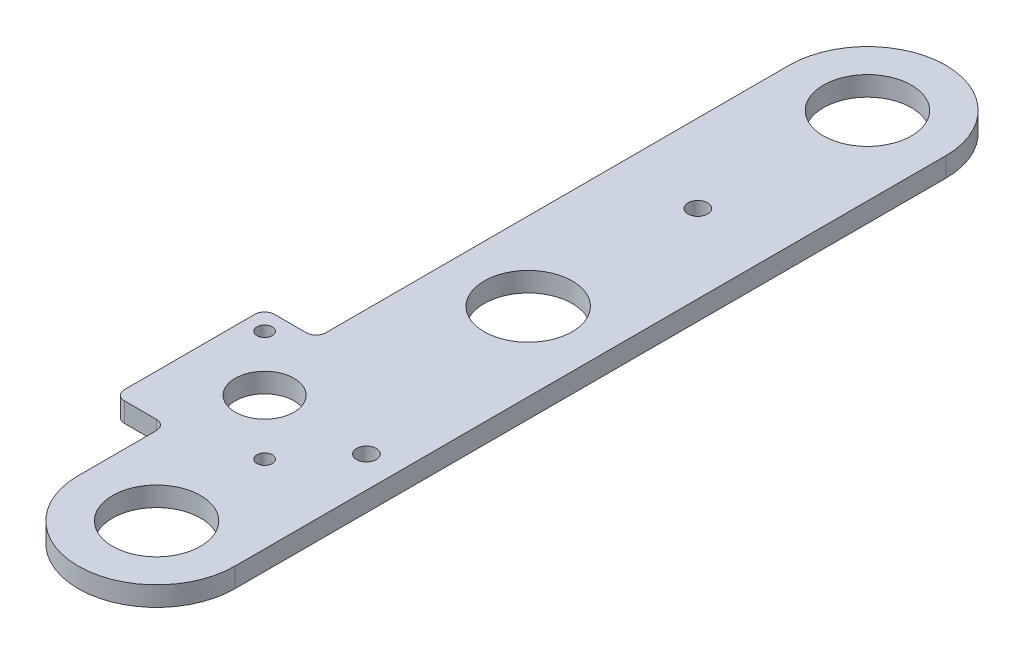
ISO-10303-21;
HEADER;
FILE_DESCRIPTION(('STEP AP214'),'2;1');
FILE_NAME('part.step','',(''),(''),'','','');
FILE_SCHEMA(('AUTOMOTIVE_DESIGN { 1 0 10303 214 1 1 1 1 }'));
ENDSEC;
DATA;
#1=APPLICATION_CONTEXT('core data for automotive mechanical design processes');
#2=APPLICATION_PROTOCOL_DEFINITION('international standard','automotive_design',2000,#1);
#3=PRODUCT_CONTEXT('',#1,'mechanical');
#4=PRODUCT('Part','Part','',(#3));
#5=PRODUCT_RELATED_PRODUCT_CATEGORY('part','',(#4));
#6=PRODUCT_DEFINITION_FORMATION('','',#4);
#7=PRODUCT_DEFINITION_CONTEXT('part definition',#1,'design');
#8=PRODUCT_DEFINITION('design','',#6,#7);
#9=PRODUCT_DEFINITION_SHAPE('','',#8);
#10=(LENGTH_UNIT() NAMED_UNIT(*) SI_UNIT(.MILLI.,.METRE.));
#11=(NAMED_UNIT(*) PLANE_ANGLE_UNIT() SI_UNIT($,.RADIAN.));
#12=(NAMED_UNIT(*) SI_UNIT($,.STERADIAN.) SOLID_ANGLE_UNIT());
#13=UNCERTAINTY_MEASURE_WITH_UNIT(LENGTH_MEASURE(1.E-05),#10,'distance_accuracy_value','');
#14=(GEOMETRIC_REPRESENTATION_CONTEXT(3) GLOBAL_UNCERTAINTY_ASSIGNED_CONTEXT((#13)) GLOBAL_UNIT_ASSIGNED_CONTEXT((#10,
#11,#12)) REPRESENTATION_CONTEXT('',''));
#15=CARTESIAN_POINT('',(0.,0.,0.));
#16=DIRECTION('',(0.,0.,1.));
#17=DIRECTION('',(1.,0.,0.));
#18=AXIS2_PLACEMENT_3D('',#15,#16,#17);
#19=CARTESIAN_POINT('',(-239.395,6.35,-397.808393353847));
#20=DIRECTION('',(0.,-1.,0.));
#21=DIRECTION('',(0.,0.,-1.));
#22=AXIS2_PLACEMENT_3D('',#19,#20,#21);
#23=CYLINDRICAL_SURFACE('',#22,3.17500000000003);
#24=CARTESIAN_POINT('',(-239.395,0.,-397.808393353847));
#25=DIRECTION('',(0.,1.,0.));
#26=DIRECTION('',(0.,0.,1.));
#27=AXIS2_PLACEMENT_3D('',#24,#25,#26);
#28=CIRCLE('',#27,3.17500000000003);
#29=CARTESIAN_POINT('',(-239.395,0.,-394.633393353847));
#30=VERTEX_POINT('',#29);
#31=CARTESIAN_POINT('',(-236.22,0.,-397.808393353847));
#32=VERTEX_POINT('',#31);
#33=EDGE_CURVE('E178',#30,#32,#28,.T.);
#34=ORIENTED_EDGE('',*,*,#33,.F.);
#35=DIRECTION('',(0.,-1.,0.));
#36=VECTOR('',#35,1.);
#37=CARTESIAN_POINT('',(-239.395,6.35,-394.633393353847));
#38=LINE('',#37,#36);
#39=CARTESIAN_POINT('',(-239.395,6.35,-394.633393353847));
#40=VERTEX_POINT('',#39);
#41=EDGE_CURVE('E11',#40,#30,#38,.T.);
#42=ORIENTED_EDGE('',*,*,#41,.F.);
#43=CARTESIAN_POINT('',(-239.395,6.35,-397.808393353847));
#44=DIRECTION('',(0.,1.,0.));
#45=DIRECTION('',(0.,0.,1.));
#46=AXIS2_PLACEMENT_3D('',#43,#44,#45);
#47=CIRCLE('',#46,3.17500000000003);
#48=CARTESIAN_POINT('',(-236.22,6.35,-397.808393353847));
#49=VERTEX_POINT('',#48);
#50=EDGE_CURVE('E259',#40,#49,#47,.T.);
#51=ORIENTED_EDGE('',*,*,#50,.T.);
#52=DIRECTION('',(0.,-1.,0.));
#53=VECTOR('',#52,1.);
#54=CARTESIAN_POINT('',(-236.22,6.35,-397.808393353847));
#55=LINE('',#54,#53);
#56=EDGE_CURVE('E51',#49,#32,#55,.T.);
#57=ORIENTED_EDGE('',*,*,#56,.T.);
#58=EDGE_LOOP('',(#34,#42,#51,#57));
#59=FACE_BOUND('',#58,.T.);
#60=ADVANCED_FACE('F34',(#59),#23,.F.);
#61=CARTESIAN_POINT('',(0.,6.35,-394.633393353847));
#62=DIRECTION('',(0.,0.,-1.));
#63=DIRECTION('',(-1.,0.,0.));
#64=AXIS2_PLACEMENT_3D('',#61,#62,#63);
#65=PLANE('',#64);
#66=DIRECTION('',(1.,0.,0.));
#67=VECTOR('',#66,1.);
#68=CARTESIAN_POINT('',(0.,0.,-394.633393353847));
#69=LINE('',#68,#67);
#70=CARTESIAN_POINT('',(-249.735512242138,0.,-394.633393353847));
#71=VERTEX_POINT('',#70);
#72=EDGE_CURVE('E180',#71,#30,#69,.T.);
#73=ORIENTED_EDGE('',*,*,#72,.F.);
#74=DIRECTION('',(0.,-1.,0.));
#75=VECTOR('',#74,1.);
#76=CARTESIAN_POINT('',(-249.735512242138,6.35,-394.633393353847));
#77=LINE('',#76,#75);
#78=CARTESIAN_POINT('',(-249.735512242138,6.35,-394.633393353847));
#79=VERTEX_POINT('',#78);
#80=EDGE_CURVE('E43',#79,#71,#77,.T.);
#81=ORIENTED_EDGE('',*,*,#80,.F.);
#82=DIRECTION('',(1.,0.,0.));
#83=VECTOR('',#82,1.);
#84=CARTESIAN_POINT('',(0.,6.35,-394.633393353847));
#85=LINE('',#84,#83);
#86=EDGE_CURVE('E255',#79,#40,#85,.T.);
#87=ORIENTED_EDGE('',*,*,#86,.T.);
#88=ORIENTED_EDGE('',*,*,#41,.T.);
#89=EDGE_LOOP('',(#73,#81,#87,#88));
#90=FACE_BOUND('',#89,.T.);
#91=ADVANCED_FACE('F241',(#90),#65,.T.);
#92=CARTESIAN_POINT('',(-249.735512242138,6.35,-391.458393353847));
#93=DIRECTION('',(0.,-1.,0.));
#94=DIRECTION('',(0.,0.,-1.));
#95=AXIS2_PLACEMENT_3D('',#92,#93,#94);
#96=CYLINDRICAL_SURFACE('',#95,3.17499999999997);
#97=CARTESIAN_POINT('',(-249.735512242138,0.,-391.458393353847));
#98=DIRECTION('',(0.,1.,0.));
#99=DIRECTION('',(0.,0.,1.));
#100=AXIS2_PLACEMENT_3D('',#97,#98,#99);
#101=CIRCLE('',#100,3.17499999999997);
#102=CARTESIAN_POINT('',(-252.910512242138,0.,-391.458393353847));
#103=VERTEX_POINT('',#102);
#104=EDGE_CURVE('E183',#103,#71,#101,.F.);
#105=ORIENTED_EDGE('',*,*,#104,.F.);
#106=DIRECTION('',(0.,-1.,0.));
#107=VECTOR('',#106,1.);
#108=CARTESIAN_POINT('',(-252.910512242138,6.35,-391.458393353847));
#109=LINE('',#108,#107);
#110=CARTESIAN_POINT('',(-252.910512242138,6.35,-391.458393353847));
#111=VERTEX_POINT('',#110);
#112=EDGE_CURVE('E230',#111,#103,#109,.T.);
#113=ORIENTED_EDGE('',*,*,#112,.F.);
#114=CARTESIAN_POINT('',(-249.735512242138,6.35,-391.458393353847));
#115=DIRECTION('',(0.,1.,0.));
#116=DIRECTION('',(0.,0.,1.));
#117=AXIS2_PLACEMENT_3D('',#114,#115,#116);
#118=CIRCLE('',#117,3.17499999999997);
#119=EDGE_CURVE('E237',#111,#79,#118,.F.);
#120=ORIENTED_EDGE('',*,*,#119,.T.);
#121=ORIENTED_EDGE('',*,*,#80,.T.);
#122=EDGE_LOOP('',(#105,#113,#120,#121));
#123=FACE_BOUND('',#122,.T.);
#124=ADVANCED_FACE('F235',(#123),#96,.T.);
#125=CARTESIAN_POINT('',(-252.910512242138,6.35,0.));
#126=DIRECTION('',(-1.,0.,0.));
#127=DIRECTION('',(0.,0.,1.));
#128=AXIS2_PLACEMENT_3D('',#125,#126,#127);
#129=PLANE('',#128);
#130=DIRECTION('',(0.,0.,-1.));
#131=VECTOR('',#130,1.);
#132=CARTESIAN_POINT('',(-252.910512242138,0.,0.));
#133=LINE('',#132,#131);
#134=CARTESIAN_POINT('',(-252.910512242138,0.,-349.18736886957));
#135=VERTEX_POINT('',#134);
#136=EDGE_CURVE('E186',#135,#103,#133,.T.);
#137=ORIENTED_EDGE('',*,*,#136,.F.);
#138=DIRECTION('',(0.,-1.,0.));
#139=VECTOR('',#138,1.);
#140=CARTESIAN_POINT('',(-252.910512242138,6.35,-349.18736886957));
#141=LINE('',#140,#139);
#142=CARTESIAN_POINT('',(-252.910512242138,6.35,-349.18736886957));
#143=VERTEX_POINT('',#142);
#144=EDGE_CURVE('E228',#143,#135,#141,.T.);
#145=ORIENTED_EDGE('',*,*,#144,.F.);
#146=DIRECTION('',(0.,0.,-1.));
#147=VECTOR('',#146,1.);
#148=CARTESIAN_POINT('',(-252.910512242138,6.35,0.));
#149=LINE('',#148,#147);
#150=EDGE_CURVE('E252',#143,#111,#149,.T.);
#151=ORIENTED_EDGE('',*,*,#150,.T.);
#152=ORIENTED_EDGE('',*,*,#112,.T.);
#153=EDGE_LOOP('',(#137,#145,#151,#152));
#154=FACE_BOUND('',#153,.T.);
#155=ADVANCED_FACE('F249',(#154),#129,.T.);
#156=CARTESIAN_POINT('',(-249.735512242138,6.35,-349.18736886957));
#157=DIRECTION('',(0.,-1.,0.));
#158=DIRECTION('',(0.,0.,-1.));
#159=AXIS2_PLACEMENT_3D('',#156,#157,#158);
#160=CYLINDRICAL_SURFACE('',#159,3.175);
#161=CARTESIAN_POINT('',(-249.735512242138,0.,-349.18736886957));
#162=DIRECTION('',(0.,1.,0.));
#163=DIRECTION('',(0.,0.,1.));
#164=AXIS2_PLACEMENT_3D('',#161,#162,#163);
#165=CIRCLE('',#164,3.175);
#166=CARTESIAN_POINT('',(-249.735512242138,0.,-346.01236886957));
#167=VERTEX_POINT('',#166);
#168=EDGE_CURVE('E189',#167,#135,#165,.F.);
#169=ORIENTED_EDGE('',*,*,#168,.F.);
#170=DIRECTION('',(0.,-1.,0.));
#171=VECTOR('',#170,1.);
#172=CARTESIAN_POINT('',(-249.735512242138,6.35,-346.01236886957));
#173=LINE('',#172,#171);
#174=CARTESIAN_POINT('',(-249.735512242138,6.35,-346.01236886957));
#175=VERTEX_POINT('',#174);
#176=EDGE_CURVE('E226',#175,#167,#173,.T.);
#177=ORIENTED_EDGE('',*,*,#176,.F.);
#178=CARTESIAN_POINT('',(-249.735512242138,6.35,-349.18736886957));
#179=DIRECTION('',(0.,1.,0.));
#180=DIRECTION('',(0.,0.,1.));
#181=AXIS2_PLACEMENT_3D('',#178,#179,#180);
#182=CIRCLE('',#181,3.175);
#183=EDGE_CURVE('E257',#175,#143,#182,.F.);
#184=ORIENTED_EDGE('',*,*,#183,.T.);
#185=ORIENTED_EDGE('',*,*,#144,.T.);
#186=EDGE_LOOP('',(#169,#177,#184,#185));
#187=FACE_BOUND('',#186,.T.);
#188=ADVANCED_FACE('F449',(#187),#160,.T.);
#189=CARTESIAN_POINT('',(-1.85750420157451E-12,6.35,-346.012368869572));
#190=DIRECTION('',(0.,0.,-1.));
#191=DIRECTION('',(-1.,0.,0.));
#192=AXIS2_PLACEMENT_3D('',#189,#190,#191);
#193=PLANE('',#192);
#194=DIRECTION('',(1.,0.,0.));
#195=VECTOR('',#194,1.);
#196=CARTESIAN_POINT('',(-1.85750420157451E-12,0.,-346.012368869572));
#197=LINE('',#196,#195);
#198=CARTESIAN_POINT('',(-239.395,0.,-346.01236886957));
#199=VERTEX_POINT('',#198);
#200=EDGE_CURVE('E192',#167,#199,#197,.T.);
#201=ORIENTED_EDGE('',*,*,#200,.T.);
#202=DIRECTION('',(0.,-1.,0.));
#203=VECTOR('',#202,1.);
#204=CARTESIAN_POINT('',(-239.395,6.35,-346.01236886957));
#205=LINE('',#204,#203);
#206=CARTESIAN_POINT('',(-239.395,6.35,-346.01236886957));
#207=VERTEX_POINT('',#206);
#208=EDGE_CURVE('E223',#207,#199,#205,.T.);
#209=ORIENTED_EDGE('',*,*,#208,.F.);
#210=DIRECTION('',(1.,0.,0.));
#211=VECTOR('',#210,1.);
#212=CARTESIAN_POINT('',(-1.85750420157451E-12,6.35,-346.012368869572));
#213=LINE('',#212,#211);
#214=EDGE_CURVE('E264',#175,#207,#213,.T.);
#215=ORIENTED_EDGE('',*,*,#214,.F.);
#216=ORIENTED_EDGE('',*,*,#176,.T.);
#217=EDGE_LOOP('',(#201,#209,#215,#216));
#218=FACE_BOUND('',#217,.T.);
#219=ADVANCED_FACE('F440',(#218),#193,.F.);
#220=CARTESIAN_POINT('',(-239.395,6.35,-342.83736886957));
#221=DIRECTION('',(0.,-1.,0.));
#222=DIRECTION('',(0.,0.,-1.));
#223=AXIS2_PLACEMENT_3D('',#220,#221,#222);
#224=CYLINDRICAL_SURFACE('',#223,3.17500000000004);
#225=CARTESIAN_POINT('',(-239.395,0.,-342.83736886957));
#226=DIRECTION('',(0.,1.,0.));
#227=DIRECTION('',(0.,0.,1.));
#228=AXIS2_PLACEMENT_3D('',#225,#226,#227);
#229=CIRCLE('',#228,3.17500000000004);
#230=CARTESIAN_POINT('',(-236.22,0.,-342.83736886957));
#231=VERTEX_POINT('',#230);
#232=EDGE_CURVE('E195',#199,#231,#229,.F.);
#233=ORIENTED_EDGE('',*,*,#232,.T.);
#234=DIRECTION('',(0.,-1.,0.));
#235=VECTOR('',#234,1.);
#236=CARTESIAN_POINT('',(-236.22,6.35,-342.83736886957));
#237=LINE('',#236,#235);
#238=CARTESIAN_POINT('',(-236.22,6.35,-342.83736886957));
#239=VERTEX_POINT('',#238);
#240=EDGE_CURVE('E220',#239,#231,#237,.T.);
#241=ORIENTED_EDGE('',*,*,#240,.F.);
#242=CARTESIAN_POINT('',(-239.395,6.35,-342.83736886957));
#243=DIRECTION('',(0.,1.,0.));
#244=DIRECTION('',(0.,0.,1.));
#245=AXIS2_PLACEMENT_3D('',#242,#243,#244);
#246=CIRCLE('',#245,3.17500000000004);
#247=EDGE_CURVE('E267',#207,#239,#246,.F.);
#248=ORIENTED_EDGE('',*,*,#247,.F.);
#249=ORIENTED_EDGE('',*,*,#208,.T.);
#250=EDGE_LOOP('',(#233,#241,#248,#249));
#251=FACE_BOUND('',#250,.T.);
#252=ADVANCED_FACE('F432',(#251),#224,.F.);
#253=CARTESIAN_POINT('',(-236.22,6.35,-2.58764913818577E-13));
#254=DIRECTION('',(1.,0.,0.));
#255=DIRECTION('',(0.,0.,-1.));
#256=AXIS2_PLACEMENT_3D('',#253,#254,#255);
#257=PLANE('',#256);
#258=DIRECTION('',(0.,0.,1.));
#259=VECTOR('',#258,1.);
#260=CARTESIAN_POINT('',(-236.22,0.,-2.58764913818577E-13));
#261=LINE('',#260,#259);
#262=CARTESIAN_POINT('',(-236.22,0.,-317.5));
#263=VERTEX_POINT('',#262);
#264=EDGE_CURVE('E198',#231,#263,#261,.T.);
#265=ORIENTED_EDGE('',*,*,#264,.T.);
#266=DIRECTION('',(0.,-1.,0.));
#267=VECTOR('',#266,1.);
#268=CARTESIAN_POINT('',(-236.22,6.35,-317.5));
#269=LINE('',#268,#267);
#270=CARTESIAN_POINT('',(-236.22,6.35,-317.5));
#271=VERTEX_POINT('',#270);
#272=EDGE_CURVE('E217',#271,#263,#269,.T.);
#273=ORIENTED_EDGE('',*,*,#272,.F.);
#274=DIRECTION('',(0.,0.,1.));
#275=VECTOR('',#274,1.);
#276=CARTESIAN_POINT('',(-236.22,6.35,-2.58764913818577E-13));
#277=LINE('',#276,#275);
#278=EDGE_CURVE('E149',#239,#271,#277,.T.);
#279=ORIENTED_EDGE('',*,*,#278,.F.);
#280=ORIENTED_EDGE('',*,*,#240,.T.);
#281=EDGE_LOOP('',(#265,#273,#279,#280));
#282=FACE_BOUND('',#281,.T.);
#283=ADVANCED_FACE('F272',(#282),#257,.F.);
#284=CARTESIAN_POINT('',(-210.82,6.35,-317.5));
#285=DIRECTION('',(0.,-1.,0.));
#286=DIRECTION('',(0.,0.,-1.));
#287=AXIS2_PLACEMENT_3D('',#284,#285,#286);
#288=CYLINDRICAL_SURFACE('',#287,25.4);
#289=CARTESIAN_POINT('',(-210.82,0.,-317.5));
#290=DIRECTION('',(0.,1.,0.));
#291=DIRECTION('',(0.,0.,1.));
#292=AXIS2_PLACEMENT_3D('',#289,#290,#291);
#293=CIRCLE('',#292,25.4);
#294=CARTESIAN_POINT('',(-185.42,0.,-317.5));
#295=VERTEX_POINT('',#294);
#296=EDGE_CURVE('E201',#263,#295,#293,.T.);
#297=ORIENTED_EDGE('',*,*,#296,.T.);
#298=DIRECTION('',(0.,-1.,0.));
#299=VECTOR('',#298,1.);
#300=CARTESIAN_POINT('',(-185.42,6.35,-317.5));
#301=LINE('',#300,#299);
#302=CARTESIAN_POINT('',(-185.42,6.35,-317.5));
#303=VERTEX_POINT('',#302);
#304=EDGE_CURVE('E135',#303,#295,#301,.T.);
#305=ORIENTED_EDGE('',*,*,#304,.F.);
#306=CARTESIAN_POINT('',(-210.82,6.35,-317.5));
#307=DIRECTION('',(0.,1.,0.));
#308=DIRECTION('',(0.,0.,1.));
#309=AXIS2_PLACEMENT_3D('',#306,#307,#308);
#310=CIRCLE('',#309,25.4);
#311=EDGE_CURVE('E146',#271,#303,#310,.T.);
#312=ORIENTED_EDGE('',*,*,#311,.F.);
#313=ORIENTED_EDGE('',*,*,#272,.T.);
#314=EDGE_LOOP('',(#297,#305,#312,#313));
#315=FACE_BOUND('',#314,.T.);
#316=ADVANCED_FACE('F274',(#315),#288,.T.);
#317=CARTESIAN_POINT('',(-185.42,6.35,0.));
#318=DIRECTION('',(1.,0.,0.));
#319=DIRECTION('',(0.,0.,-1.));
#320=AXIS2_PLACEMENT_3D('',#317,#318,#319);
#321=PLANE('',#320);
#322=DIRECTION('',(0.,0.,1.));
#323=VECTOR('',#322,1.);
#324=CARTESIAN_POINT('',(-185.42,0.,0.));
#325=LINE('',#324,#323);
#326=CARTESIAN_POINT('',(-185.42,0.,-548.034576396425));
#327=VERTEX_POINT('',#326);
#328=EDGE_CURVE('E132',#327,#295,#325,.T.);
#329=ORIENTED_EDGE('',*,*,#328,.F.);
#330=DIRECTION('',(0.,-1.,0.));
#331=VECTOR('',#330,1.);
#332=CARTESIAN_POINT('',(-185.42,6.35,-548.034576396425));
#333=LINE('',#332,#331);
#334=CARTESIAN_POINT('',(-185.42,6.35,-548.034576396425));
#335=VERTEX_POINT('',#334);
#336=EDGE_CURVE('E126',#335,#327,#333,.T.);
#337=ORIENTED_EDGE('',*,*,#336,.F.);
#338=DIRECTION('',(0.,0.,1.));
#339=VECTOR('',#338,1.);
#340=CARTESIAN_POINT('',(-185.42,6.35,0.));
#341=LINE('',#340,#339);
#342=EDGE_CURVE('E130',#335,#303,#341,.T.);
#343=ORIENTED_EDGE('',*,*,#342,.T.);
#344=ORIENTED_EDGE('',*,*,#304,.T.);
#345=EDGE_LOOP('',(#329,#337,#343,#344));
#346=FACE_BOUND('',#345,.T.);
#347=ADVANCED_FACE('F128',(#346),#321,.T.);
#348=CARTESIAN_POINT('',(-210.82,6.35,-548.034576396425));
#349=DIRECTION('',(0.,-1.,0.));
#350=DIRECTION('',(0.,0.,-1.));
#351=AXIS2_PLACEMENT_3D('',#348,#349,#350);
#352=CYLINDRICAL_SURFACE('',#351,25.4);
#353=CARTESIAN_POINT('',(-210.82,0.,-548.034576396425));
#354=DIRECTION('',(0.,1.,0.));
#355=DIRECTION('',(0.,0.,1.));
#356=AXIS2_PLACEMENT_3D('',#353,#354,#355);
#357=CIRCLE('',#356,25.4);
#358=CARTESIAN_POINT('',(-236.22,0.,-548.034576396425));
#359=VERTEX_POINT('',#358);
#360=EDGE_CURVE('E205',#327,#359,#357,.T.);
#361=ORIENTED_EDGE('',*,*,#360,.T.);
#362=DIRECTION('',(0.,-1.,0.));
#363=VECTOR('',#362,1.);
#364=CARTESIAN_POINT('',(-236.22,6.35,-548.034576396425));
#365=LINE('',#364,#363);
#366=CARTESIAN_POINT('',(-236.22,6.35,-548.034576396425));
#367=VERTEX_POINT('',#366);
#368=EDGE_CURVE('E89',#367,#359,#365,.T.);
#369=ORIENTED_EDGE('',*,*,#368,.F.);
#370=CARTESIAN_POINT('',(-210.82,6.35,-548.034576396425));
#371=DIRECTION('',(0.,1.,0.));
#372=DIRECTION('',(0.,0.,1.));
#373=AXIS2_PLACEMENT_3D('',#370,#371,#372);
#374=CIRCLE('',#373,25.4);
#375=EDGE_CURVE('E137',#335,#367,#374,.T.);
#376=ORIENTED_EDGE('',*,*,#375,.F.);
#377=ORIENTED_EDGE('',*,*,#336,.T.);
#378=EDGE_LOOP('',(#361,#369,#376,#377));
#379=FACE_BOUND('',#378,.T.);
#380=ADVANCED_FACE('F138',(#379),#352,.T.);
#381=CARTESIAN_POINT('',(-236.22,6.35,0.));
#382=DIRECTION('',(-1.,0.,0.));
#383=DIRECTION('',(0.,0.,1.));
#384=AXIS2_PLACEMENT_3D('',#381,#382,#383);
#385=PLANE('',#384);
#386=DIRECTION('',(0.,0.,-1.));
#387=VECTOR('',#386,1.);
#388=CARTESIAN_POINT('',(-236.22,0.,0.));
#389=LINE('',#388,#387);
#390=EDGE_CURVE('E207',#32,#359,#389,.T.);
#391=ORIENTED_EDGE('',*,*,#390,.F.);
#392=ORIENTED_EDGE('',*,*,#56,.F.);
#393=DIRECTION('',(0.,0.,-1.));
#394=VECTOR('',#393,1.);
#395=CARTESIAN_POINT('',(-236.22,6.35,0.));
#396=LINE('',#395,#394);
#397=EDGE_CURVE('E141',#49,#367,#396,.T.);
#398=ORIENTED_EDGE('',*,*,#397,.T.);
#399=ORIENTED_EDGE('',*,*,#368,.T.);
#400=EDGE_LOOP('',(#391,#392,#398,#399));
#401=FACE_BOUND('',#400,.T.);
#402=ADVANCED_FACE('F275',(#401),#385,.T.);
#403=CARTESIAN_POINT('',(-246.560512242138,6.35,-388.283393353847));
#404=DIRECTION('',(0.,-1.,0.));
#405=DIRECTION('',(0.,0.,-1.));
#406=AXIS2_PLACEMENT_3D('',#403,#404,#405);
#407=CYLINDRICAL_SURFACE('',#406,2.48920000000001);
#408=CARTESIAN_POINT('',(-246.560512242138,6.35,-388.283393353847));
#409=DIRECTION('',(0.,1.,0.));
#410=DIRECTION('',(0.,0.,1.));
#411=AXIS2_PLACEMENT_3D('',#408,#409,#410);
#412=CIRCLE('',#411,2.48920000000001);
#413=CARTESIAN_POINT('',(-246.560512242138,6.35,-385.794193353847));
#414=VERTEX_POINT('',#413);
#415=EDGE_CURVE('E523',#414,#414,#412,.T.);
#416=ORIENTED_EDGE('',*,*,#415,.T.);
#417=EDGE_LOOP('',(#416));
#418=FACE_BOUND('',#417,.T.);
#419=CARTESIAN_POINT('',(-246.560512242138,0.,-388.283393353847));
#420=DIRECTION('',(0.,1.,0.));
#421=DIRECTION('',(0.,0.,1.));
#422=AXIS2_PLACEMENT_3D('',#419,#420,#421);
#423=CIRCLE('',#422,2.48920000000001);
#424=CARTESIAN_POINT('',(-246.560512242138,0.,-385.794193353847));
#425=VERTEX_POINT('',#424);
#426=EDGE_CURVE('E175',#425,#425,#423,.T.);
#427=ORIENTED_EDGE('',*,*,#426,.F.);
#428=EDGE_LOOP('',(#427));
#429=FACE_BOUND('',#428,.T.);
#430=ADVANCED_FACE('F277',(#418,#429),#407,.F.);
#431=CARTESIAN_POINT('',(-210.639487757862,6.35,-352.36236886957));
#432=DIRECTION('',(0.,-1.,0.));
#433=DIRECTION('',(0.,0.,-1.));
#434=AXIS2_PLACEMENT_3D('',#431,#432,#433);
#435=CYLINDRICAL_SURFACE('',#434,2.48920000000001);
#436=CARTESIAN_POINT('',(-210.639487757862,6.35,-352.36236886957));
#437=DIRECTION('',(0.,1.,0.));
#438=DIRECTION('',(0.,0.,1.));
#439=AXIS2_PLACEMENT_3D('',#436,#437,#438);
#440=CIRCLE('',#439,2.48920000000001);
#441=CARTESIAN_POINT('',(-210.639487757862,6.35,-349.87316886957));
#442=VERTEX_POINT('',#441);
#443=EDGE_CURVE('E520',#442,#442,#440,.T.);
#444=ORIENTED_EDGE('',*,*,#443,.T.);
#445=EDGE_LOOP('',(#444));
#446=FACE_BOUND('',#445,.T.);
#447=CARTESIAN_POINT('',(-210.639487757862,0.,-352.36236886957));
#448=DIRECTION('',(0.,1.,0.));
#449=DIRECTION('',(0.,0.,1.));
#450=AXIS2_PLACEMENT_3D('',#447,#448,#449);
#451=CIRCLE('',#450,2.48920000000001);
#452=CARTESIAN_POINT('',(-210.639487757862,0.,-349.87316886957));
#453=VERTEX_POINT('',#452);
#454=EDGE_CURVE('E172',#453,#453,#451,.T.);
#455=ORIENTED_EDGE('',*,*,#454,.F.);
#456=EDGE_LOOP('',(#455));
#457=FACE_BOUND('',#456,.T.);
#458=ADVANCED_FACE('F283',(#446,#457),#435,.F.);
#459=CARTESIAN_POINT('',(-210.82,6.35,-548.034576396425));
#460=DIRECTION('',(0.,-1.,0.));
#461=DIRECTION('',(0.,0.,-1.));
#462=AXIS2_PLACEMENT_3D('',#459,#460,#461);
#463=CYLINDRICAL_SURFACE('',#462,14.2748);
#464=CARTESIAN_POINT('',(-210.82,6.35,-548.034576396425));
#465=DIRECTION('',(0.,1.,0.));
#466=DIRECTION('',(0.,0.,1.));
#467=AXIS2_PLACEMENT_3D('',#464,#465,#466);
#468=CIRCLE('',#467,14.2748);
#469=CARTESIAN_POINT('',(-210.82,6.35,-533.759776396425));
#470=VERTEX_POINT('',#469);
#471=EDGE_CURVE('E516',#470,#470,#468,.T.);
#472=ORIENTED_EDGE('',*,*,#471,.T.);
#473=EDGE_LOOP('',(#472));
#474=FACE_BOUND('',#473,.T.);
#475=CARTESIAN_POINT('',(-210.82,0.,-548.034576396425));
#476=DIRECTION('',(0.,1.,0.));
#477=DIRECTION('',(0.,0.,1.));
#478=AXIS2_PLACEMENT_3D('',#475,#476,#477);
#479=CIRCLE('',#478,14.2748);
#480=CARTESIAN_POINT('',(-210.82,0.,-533.759776396425));
#481=VERTEX_POINT('',#480);
#482=EDGE_CURVE('E169',#481,#481,#479,.T.);
#483=ORIENTED_EDGE('',*,*,#482,.F.);
#484=EDGE_LOOP('',(#483));
#485=FACE_BOUND('',#484,.T.);
#486=ADVANCED_FACE('F298',(#474,#485),#463,.F.);
#487=CARTESIAN_POINT('',(-195.58,6.35,-370.322881111709));
#488=DIRECTION('',(0.,-1.,0.));
#489=DIRECTION('',(0.,0.,-1.));
#490=AXIS2_PLACEMENT_3D('',#487,#488,#489);
#491=CYLINDRICAL_SURFACE('',#490,3.175);
#492=CARTESIAN_POINT('',(-195.58,6.35,-370.322881111709));
#493=DIRECTION('',(0.,1.,0.));
#494=DIRECTION('',(0.,0.,1.));
#495=AXIS2_PLACEMENT_3D('',#492,#493,#494);
#496=CIRCLE('',#495,3.175);
#497=CARTESIAN_POINT('',(-195.58,6.35,-367.147881111709));
#498=VERTEX_POINT('',#497);
#499=EDGE_CURVE('E512',#498,#498,#496,.T.);
#500=ORIENTED_EDGE('',*,*,#499,.T.);
#501=EDGE_LOOP('',(#500));
#502=FACE_BOUND('',#501,.T.);
#503=CARTESIAN_POINT('',(-195.58,0.,-370.322881111709));
#504=DIRECTION('',(0.,1.,0.));
#505=DIRECTION('',(0.,0.,1.));
#506=AXIS2_PLACEMENT_3D('',#503,#504,#505);
#507=CIRCLE('',#506,3.175);
#508=CARTESIAN_POINT('',(-195.58,0.,-367.147881111709));
#509=VERTEX_POINT('',#508);
#510=EDGE_CURVE('E166',#509,#509,#507,.T.);
#511=ORIENTED_EDGE('',*,*,#510,.F.);
#512=EDGE_LOOP('',(#511));
#513=FACE_BOUND('',#512,.T.);
#514=ADVANCED_FACE('F302',(#502,#513),#491,.F.);
#515=CARTESIAN_POINT('',(-210.82,6.35,-493.030876396425));
#516=DIRECTION('',(0.,-1.,0.));
#517=DIRECTION('',(0.,0.,-1.));
#518=AXIS2_PLACEMENT_3D('',#515,#516,#517);
#519=CYLINDRICAL_SURFACE('',#518,3.175);
#520=CARTESIAN_POINT('',(-210.82,6.35,-493.030876396425));
#521=DIRECTION('',(0.,1.,0.));
#522=DIRECTION('',(0.,0.,1.));
#523=AXIS2_PLACEMENT_3D('',#520,#521,#522);
#524=CIRCLE('',#523,3.175);
#525=CARTESIAN_POINT('',(-210.82,6.35,-489.855876396425));
#526=VERTEX_POINT('',#525);
#527=EDGE_CURVE('E508',#526,#526,#524,.T.);
#528=ORIENTED_EDGE('',*,*,#527,.T.);
#529=EDGE_LOOP('',(#528));
#530=FACE_BOUND('',#529,.T.);
#531=CARTESIAN_POINT('',(-210.82,0.,-493.030876396425));
#532=DIRECTION('',(0.,1.,0.));
#533=DIRECTION('',(0.,0.,1.));
#534=AXIS2_PLACEMENT_3D('',#531,#532,#533);
#535=CIRCLE('',#534,3.175);
#536=CARTESIAN_POINT('',(-210.82,0.,-489.855876396425));
#537=VERTEX_POINT('',#536);
#538=EDGE_CURVE('E163',#537,#537,#535,.T.);
#539=ORIENTED_EDGE('',*,*,#538,.F.);
#540=EDGE_LOOP('',(#539));
#541=FACE_BOUND('',#540,.T.);
#542=ADVANCED_FACE('F306',(#530,#541),#519,.F.);
#543=CARTESIAN_POINT('',(-228.6,6.35,-370.322881111709));
#544=DIRECTION('',(0.,-1.,0.));
#545=DIRECTION('',(0.,0.,-1.));
#546=AXIS2_PLACEMENT_3D('',#543,#544,#545);
#547=CYLINDRICAL_SURFACE('',#546,9.52499999999999);
#548=CARTESIAN_POINT('',(-228.6,6.35,-370.322881111709));
#549=DIRECTION('',(0.,1.,0.));
#550=DIRECTION('',(0.,0.,1.));
#551=AXIS2_PLACEMENT_3D('',#548,#549,#550);
#552=CIRCLE('',#551,9.52499999999999);
#553=CARTESIAN_POINT('',(-228.6,6.35,-360.797881111709));
#554=VERTEX_POINT('',#553);
#555=EDGE_CURVE('E321',#554,#554,#552,.T.);
#556=ORIENTED_EDGE('',*,*,#555,.T.);
#557=EDGE_LOOP('',(#556));
#558=FACE_BOUND('',#557,.T.);
#559=CARTESIAN_POINT('',(-228.6,0.,-370.322881111709));
#560=DIRECTION('',(0.,1.,0.));
#561=DIRECTION('',(0.,0.,1.));
#562=AXIS2_PLACEMENT_3D('',#559,#560,#561);
#563=CIRCLE('',#562,9.52499999999999);
#564=CARTESIAN_POINT('',(-228.6,0.,-360.797881111709));
#565=VERTEX_POINT('',#564);
#566=EDGE_CURVE('E160',#565,#565,#563,.T.);
#567=ORIENTED_EDGE('',*,*,#566,.F.);
#568=EDGE_LOOP('',(#567));
#569=FACE_BOUND('',#568,.T.);
#570=ADVANCED_FACE('F309',(#558,#569),#547,.F.);
#571=CARTESIAN_POINT('',(-210.82,6.35,-438.027176396425));
#572=DIRECTION('',(0.,-1.,0.));
#573=DIRECTION('',(0.,0.,-1.));
#574=AXIS2_PLACEMENT_3D('',#571,#572,#573);
#575=CYLINDRICAL_SURFACE('',#574,14.2748);
#576=CARTESIAN_POINT('',(-210.82,6.35,-438.027176396425));
#577=DIRECTION('',(0.,1.,0.));
#578=DIRECTION('',(0.,0.,1.));
#579=AXIS2_PLACEMENT_3D('',#576,#577,#578);
#580=CIRCLE('',#579,14.2748);
#581=CARTESIAN_POINT('',(-210.82,6.35,-423.752376396424));
#582=VERTEX_POINT('',#581);
#583=EDGE_CURVE('E213',#582,#582,#580,.T.);
#584=ORIENTED_EDGE('',*,*,#583,.T.);
#585=EDGE_LOOP('',(#584));
#586=FACE_BOUND('',#585,.T.);
#587=CARTESIAN_POINT('',(-210.82,0.,-438.027176396425));
#588=DIRECTION('',(0.,1.,0.));
#589=DIRECTION('',(0.,0.,1.));
#590=AXIS2_PLACEMENT_3D('',#587,#588,#589);
#591=CIRCLE('',#590,14.2748);
#592=CARTESIAN_POINT('',(-210.82,0.,-423.752376396424));
#593=VERTEX_POINT('',#592);
#594=EDGE_CURVE('E157',#593,#593,#591,.T.);
#595=ORIENTED_EDGE('',*,*,#594,.F.);
#596=EDGE_LOOP('',(#595));
#597=FACE_BOUND('',#596,.T.);
#598=ADVANCED_FACE('F36',(#586,#597),#575,.F.);
#599=CARTESIAN_POINT('',(-210.82,6.35,-317.5));
#600=DIRECTION('',(0.,-1.,0.));
#601=DIRECTION('',(0.,0.,-1.));
#602=AXIS2_PLACEMENT_3D('',#599,#600,#601);
#603=CYLINDRICAL_SURFACE('',#602,14.2748);
#604=CARTESIAN_POINT('',(-210.82,6.35,-317.5));
#605=DIRECTION('',(0.,1.,0.));
#606=DIRECTION('',(0.,0.,1.));
#607=AXIS2_PLACEMENT_3D('',#604,#605,#606);
#608=CIRCLE('',#607,14.2748);
#609=CARTESIAN_POINT('',(-210.82,6.35,-303.2252));
#610=VERTEX_POINT('',#609);
#611=EDGE_CURVE('E154',#610,#610,#608,.T.);
#612=ORIENTED_EDGE('',*,*,#611,.T.);
#613=EDGE_LOOP('',(#612));
#614=FACE_BOUND('',#613,.T.);
#615=CARTESIAN_POINT('',(-210.82,0.,-317.5));
#616=DIRECTION('',(0.,1.,0.));
#617=DIRECTION('',(0.,0.,1.));
#618=AXIS2_PLACEMENT_3D('',#615,#616,#617);
#619=CIRCLE('',#618,14.2748);
#620=CARTESIAN_POINT('',(-210.82,0.,-303.2252));
#621=VERTEX_POINT('',#620);
#622=EDGE_CURVE('E210',#621,#621,#619,.T.);
#623=ORIENTED_EDGE('',*,*,#622,.F.);
#624=EDGE_LOOP('',(#623));
#625=FACE_BOUND('',#624,.T.);
#626=ADVANCED_FACE('F316',(#614,#625),#603,.F.);
#627=CARTESIAN_POINT('',(0.,6.35,0.));
#628=DIRECTION('',(0.,1.,0.));
#629=DIRECTION('',(0.,0.,1.));
#630=AXIS2_PLACEMENT_3D('',#627,#628,#629);
#631=PLANE('',#630);
#632=ORIENTED_EDGE('',*,*,#583,.F.);
#633=EDGE_LOOP('',(#632));
#634=FACE_BOUND('',#633,.T.);
#635=ORIENTED_EDGE('',*,*,#555,.F.);
#636=EDGE_LOOP('',(#635));
#637=FACE_BOUND('',#636,.T.);
#638=ORIENTED_EDGE('',*,*,#527,.F.);
#639=EDGE_LOOP('',(#638));
#640=FACE_BOUND('',#639,.T.);
#641=ORIENTED_EDGE('',*,*,#499,.F.);
#642=EDGE_LOOP('',(#641));
#643=FACE_BOUND('',#642,.T.);
#644=ORIENTED_EDGE('',*,*,#471,.F.);
#645=EDGE_LOOP('',(#644));
#646=FACE_BOUND('',#645,.T.);
#647=ORIENTED_EDGE('',*,*,#443,.F.);
#648=EDGE_LOOP('',(#647));
#649=FACE_BOUND('',#648,.T.);
#650=ORIENTED_EDGE('',*,*,#415,.F.);
#651=EDGE_LOOP('',(#650));
#652=FACE_BOUND('',#651,.T.);
#653=ORIENTED_EDGE('',*,*,#50,.F.);
#654=ORIENTED_EDGE('',*,*,#86,.F.);
#655=ORIENTED_EDGE('',*,*,#119,.F.);
#656=ORIENTED_EDGE('',*,*,#150,.F.);
#657=ORIENTED_EDGE('',*,*,#183,.F.);
#658=ORIENTED_EDGE('',*,*,#214,.T.);
#659=ORIENTED_EDGE('',*,*,#247,.T.);
#660=ORIENTED_EDGE('',*,*,#278,.T.);
#661=ORIENTED_EDGE('',*,*,#311,.T.);
#662=ORIENTED_EDGE('',*,*,#342,.F.);
#663=ORIENTED_EDGE('',*,*,#375,.T.);
#664=ORIENTED_EDGE('',*,*,#397,.F.);
#665=EDGE_LOOP('',(#653,#654,#655,#656,#657,#658,#659,#660,#661,#662,#663,#664));
#666=FACE_BOUND('',#665,.T.);
#667=ORIENTED_EDGE('',*,*,#611,.F.);
#668=EDGE_LOOP('',(#667));
#669=FACE_BOUND('',#668,.T.);
#670=ADVANCED_FACE('F143',(#634,#637,#640,#643,#646,#649,#652,#666,#669),#631,.T.);
#671=CARTESIAN_POINT('',(0.,0.,0.));
#672=DIRECTION('',(0.,1.,0.));
#673=DIRECTION('',(0.,0.,1.));
#674=AXIS2_PLACEMENT_3D('',#671,#672,#673);
#675=PLANE('',#674);
#676=ORIENTED_EDGE('',*,*,#594,.T.);
#677=EDGE_LOOP('',(#676));
#678=FACE_BOUND('',#677,.T.);
#679=ORIENTED_EDGE('',*,*,#566,.T.);
#680=EDGE_LOOP('',(#679));
#681=FACE_BOUND('',#680,.T.);
#682=ORIENTED_EDGE('',*,*,#538,.T.);
#683=EDGE_LOOP('',(#682));
#684=FACE_BOUND('',#683,.T.);
#685=ORIENTED_EDGE('',*,*,#510,.T.);
#686=EDGE_LOOP('',(#685));
#687=FACE_BOUND('',#686,.T.);
#688=ORIENTED_EDGE('',*,*,#482,.T.);
#689=EDGE_LOOP('',(#688));
#690=FACE_BOUND('',#689,.T.);
#691=ORIENTED_EDGE('',*,*,#454,.T.);
#692=EDGE_LOOP('',(#691));
#693=FACE_BOUND('',#692,.T.);
#694=ORIENTED_EDGE('',*,*,#426,.T.);
#695=EDGE_LOOP('',(#694));
#696=FACE_BOUND('',#695,.T.);
#697=ORIENTED_EDGE('',*,*,#33,.T.);
#698=ORIENTED_EDGE('',*,*,#390,.T.);
#699=ORIENTED_EDGE('',*,*,#360,.F.);
#700=ORIENTED_EDGE('',*,*,#328,.T.);
#701=ORIENTED_EDGE('',*,*,#296,.F.);
#702=ORIENTED_EDGE('',*,*,#264,.F.);
#703=ORIENTED_EDGE('',*,*,#232,.F.);
#704=ORIENTED_EDGE('',*,*,#200,.F.);
#705=ORIENTED_EDGE('',*,*,#168,.T.);
#706=ORIENTED_EDGE('',*,*,#136,.T.);
#707=ORIENTED_EDGE('',*,*,#104,.T.);
#708=ORIENTED_EDGE('',*,*,#72,.T.);
#709=EDGE_LOOP('',(#697,#698,#699,#700,#701,#702,#703,#704,#705,#706,#707,#708));
#710=FACE_BOUND('',#709,.T.);
#711=ORIENTED_EDGE('',*,*,#622,.T.);
#712=EDGE_LOOP('',(#711));
#713=FACE_BOUND('',#712,.T.);
#714=ADVANCED_FACE('F243',(#678,#681,#684,#687,#690,#693,#696,#710,#713),#675,.F.);
#715=CLOSED_SHELL('',(#60,#91,#124,#155,#188,#219,#252,#283,#316,#347,#380,#402,#430,#458,#486,
#514,#542,#570,#598,#626,#670,#714));
#716=MANIFOLD_SOLID_BREP('B2',#715);
#717=ADVANCED_BREP_SHAPE_REPRESENTATION('',(#18,#716),#14);
#718=SHAPE_DEFINITION_REPRESENTATION(#9,#717);
ENDSEC;
END-ISO-10303-21;
